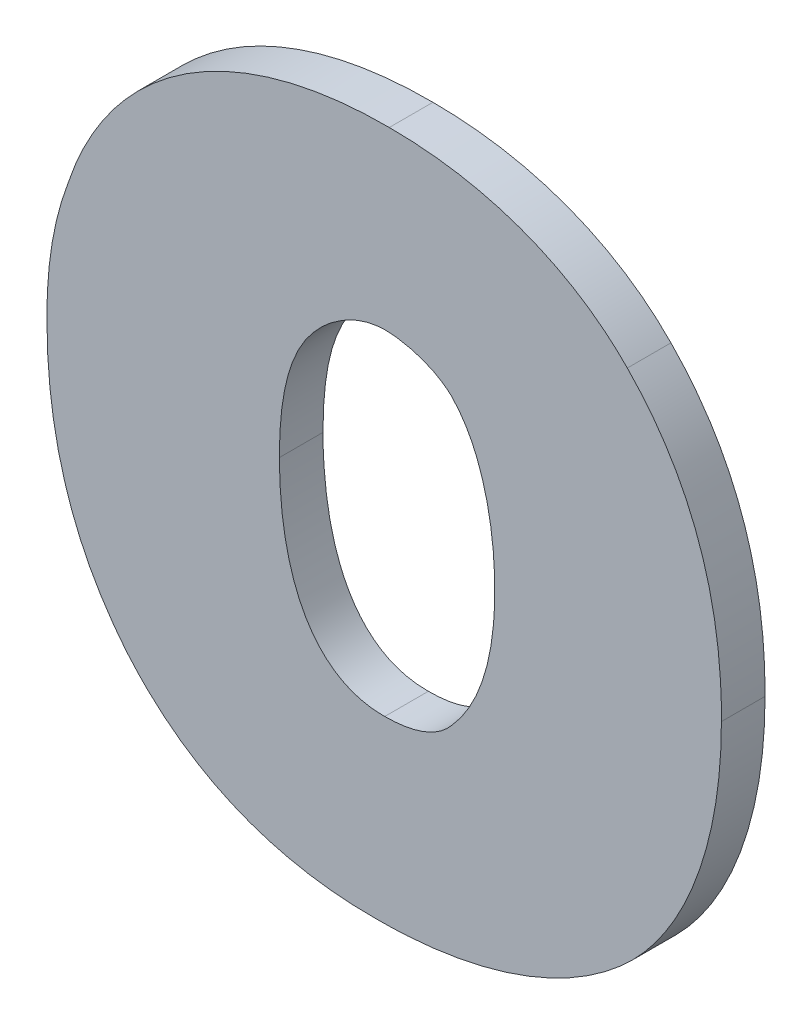
ISO-10303-21;
HEADER;
FILE_DESCRIPTION(('STEP AP214'),'2;1');
FILE_NAME('part.step','',(''),(''),'','','');
FILE_SCHEMA(('AUTOMOTIVE_DESIGN { 1 0 10303 214 1 1 1 1 }'));
ENDSEC;
DATA;
#1=APPLICATION_CONTEXT('core data for automotive mechanical design processes');
#2=APPLICATION_PROTOCOL_DEFINITION('international standard','automotive_design',2000,#1);
#3=PRODUCT_CONTEXT('',#1,'mechanical');
#4=PRODUCT('Part','Part','',(#3));
#5=PRODUCT_RELATED_PRODUCT_CATEGORY('part','',(#4));
#6=PRODUCT_DEFINITION_FORMATION('','',#4);
#7=PRODUCT_DEFINITION_CONTEXT('part definition',#1,'design');
#8=PRODUCT_DEFINITION('design','',#6,#7);
#9=PRODUCT_DEFINITION_SHAPE('','',#8);
#10=(LENGTH_UNIT() NAMED_UNIT(*) SI_UNIT(.MILLI.,.METRE.));
#11=(NAMED_UNIT(*) PLANE_ANGLE_UNIT() SI_UNIT($,.RADIAN.));
#12=(NAMED_UNIT(*) SI_UNIT($,.STERADIAN.) SOLID_ANGLE_UNIT());
#13=UNCERTAINTY_MEASURE_WITH_UNIT(LENGTH_MEASURE(1.E-05),#10,'distance_accuracy_value','');
#14=(GEOMETRIC_REPRESENTATION_CONTEXT(3) GLOBAL_UNCERTAINTY_ASSIGNED_CONTEXT((#13)) GLOBAL_UNIT_ASSIGNED_CONTEXT((#10,
#11,#12)) REPRESENTATION_CONTEXT('',''));
#15=CARTESIAN_POINT('',(0.,0.,0.));
#16=DIRECTION('',(0.,0.,1.));
#17=DIRECTION('',(1.,0.,0.));
#18=AXIS2_PLACEMENT_3D('',#15,#16,#17);
#19=CARTESIAN_POINT('',(0.124377772975997,-0.190998499455656,0.));
#20=CARTESIAN_POINT('',(0.124377772975997,-0.190998499455656,0.003));
#21=CARTESIAN_POINT('',(0.124377774804017,-0.185379031125288,0.));
#22=CARTESIAN_POINT('',(0.124377774804017,-0.185379031125288,0.003));
#23=CARTESIAN_POINT('',(0.125858627399625,-0.182877163374568,0.));
#24=CARTESIAN_POINT('',(0.125858627399625,-0.182877163374568,0.003));
#25=CARTESIAN_POINT('',(0.127885063400016,-0.181232615690537,0.));
#26=CARTESIAN_POINT('',(0.127885063400016,-0.181232615690537,0.003));
#27=B_SPLINE_SURFACE_WITH_KNOTS('',3,1,((#19,#20),(#21,#22),(#23,#24),(#25,#26)),.UNSPECIFIED.,
.F.,.F.,.F.,(4,4),(2,2),(0.,1.),(0.,0.0003),.UNSPECIFIED.);
#28=CARTESIAN_POINT('',(0.124377772975997,-0.190998499455656,0.));
#29=CARTESIAN_POINT('',(0.124377774804017,-0.185379031125288,0.));
#30=CARTESIAN_POINT('',(0.125858627399625,-0.182877163374568,0.));
#31=CARTESIAN_POINT('',(0.127885063400016,-0.181232615690537,0.));
#32=B_SPLINE_CURVE_WITH_KNOTS('',3,(#28,#29,#30,#31),.UNSPECIFIED.,.F.,.F.,(4,4),(0.,1.),.UNSPECIFIED.);
#33=CARTESIAN_POINT('',(0.124377772975997,-0.190998499455656,0.));
#34=VERTEX_POINT('',#33);
#35=CARTESIAN_POINT('',(0.127885063400016,-0.181232615690537,0.));
#36=VERTEX_POINT('',#35);
#37=EDGE_CURVE('E11',#34,#36,#32,.T.);
#38=DIRECTION('',(0.,0.,1.));
#39=VECTOR('',#38,1.);
#40=CARTESIAN_POINT('',(0.127885063400016,-0.181232615690537,0.));
#41=LINE('',#40,#39);
#42=CARTESIAN_POINT('',(0.127885063400016,-0.181232615690537,0.003));
#43=VERTEX_POINT('',#42);
#44=EDGE_CURVE('E26',#36,#43,#41,.T.);
#45=CARTESIAN_POINT('',(0.124377772975997,-0.190998499455656,0.003));
#46=CARTESIAN_POINT('',(0.124377774804017,-0.185379031125288,0.003));
#47=CARTESIAN_POINT('',(0.125858627399625,-0.182877163374568,0.003));
#48=CARTESIAN_POINT('',(0.127885063400016,-0.181232615690537,0.003));
#49=B_SPLINE_CURVE_WITH_KNOTS('',3,(#45,#46,#47,#48),.UNSPECIFIED.,.F.,.F.,(4,4),(0.,1.),.UNSPECIFIED.);
#50=CARTESIAN_POINT('',(0.124377772975997,-0.190998499455656,0.003));
#51=VERTEX_POINT('',#50);
#52=EDGE_CURVE('E528',#51,#43,#49,.T.);
#53=DIRECTION('',(0.,0.,1.));
#54=VECTOR('',#53,1.);
#55=CARTESIAN_POINT('',(0.124377772975997,-0.190998499455656,0.));
#56=LINE('',#55,#54);
#57=EDGE_CURVE('E533',#34,#51,#56,.T.);
#58=ORIENTED_EDGE('',*,*,#37,.T.);
#59=ORIENTED_EDGE('',*,*,#44,.T.);
#60=ORIENTED_EDGE('',*,*,#52,.F.);
#61=ORIENTED_EDGE('',*,*,#57,.F.);
#62=EDGE_LOOP('',(#58,#59,#60,#61));
#63=FACE_BOUND('',#62,.T.);
#64=ADVANCED_FACE('F17',(#63),#27,.T.);
#65=CARTESIAN_POINT('',(0.124377772975997,-0.190998499455656,0.));
#66=CARTESIAN_POINT('',(0.124427953984096,-0.202875820342947,0.));
#67=CARTESIAN_POINT('',(0.131626178177405,-0.20279080390148,0.));
#68=CARTESIAN_POINT('',(0.124377772975997,-0.190998499455656,0.003));
#69=CARTESIAN_POINT('',(0.124427953984096,-0.202875820342947,0.003));
#70=CARTESIAN_POINT('',(0.131626178177405,-0.20279080390148,0.003));
#71=(BOUNDED_SURFACE() B_SPLINE_SURFACE(1,2,((#65,#66,#67),(#68,#69,#70)),.UNSPECIFIED.,.F.,.F.,
.F.) B_SPLINE_SURFACE_WITH_KNOTS((2,2),(3,3),(0.,0.0703854944655545),(-3.76705345508361,
-2.96138373353767),
.UNSPECIFIED.) GEOMETRIC_REPRESENTATION_ITEM() RATIONAL_B_SPLINE_SURFACE(((1.,0.919953347677428,
1.),(1.,0.919953347677428,1.))) REPRESENTATION_ITEM('') SURFACE());
#72=CARTESIAN_POINT('',(0.131626178177405,-0.20279080390148,0.));
#73=CARTESIAN_POINT('',(0.124427953984096,-0.202875820342947,0.));
#74=CARTESIAN_POINT('',(0.124377772975997,-0.190998499455656,0.));
#75=(BOUNDED_CURVE() B_SPLINE_CURVE(2,(#72,#73,#74),.UNSPECIFIED.,.F.,
.F.) B_SPLINE_CURVE_WITH_KNOTS((3,3),(-3.76705345508361,-2.96138373353767),
.UNSPECIFIED.) CURVE() GEOMETRIC_REPRESENTATION_ITEM() RATIONAL_B_SPLINE_CURVE((1.,
0.919953347677428,1.)) REPRESENTATION_ITEM(''));
#76=CARTESIAN_POINT('',(0.131626178177405,-0.20279080390148,0.));
#77=VERTEX_POINT('',#76);
#78=EDGE_CURVE('E532',#77,#34,#75,.T.);
#79=CARTESIAN_POINT('',(0.124377772975997,-0.190998499455656,0.003));
#80=CARTESIAN_POINT('',(0.124427953984096,-0.202875820342947,0.003));
#81=CARTESIAN_POINT('',(0.131626178177405,-0.20279080390148,0.003));
#82=(BOUNDED_CURVE() B_SPLINE_CURVE(2,(#79,#80,#81),.UNSPECIFIED.,.F.,
.F.) B_SPLINE_CURVE_WITH_KNOTS((3,3),(-3.76705345508361,-2.96138373353767),
.UNSPECIFIED.) CURVE() GEOMETRIC_REPRESENTATION_ITEM() RATIONAL_B_SPLINE_CURVE((1.,
0.919953347677428,1.)) REPRESENTATION_ITEM(''));
#83=CARTESIAN_POINT('',(0.131626178177405,-0.20279080390148,0.003));
#84=VERTEX_POINT('',#83);
#85=EDGE_CURVE('E516',#84,#51,#82,.F.);
#86=DIRECTION('',(0.,0.,1.));
#87=VECTOR('',#86,1.);
#88=CARTESIAN_POINT('',(0.131626178177405,-0.20279080390148,0.));
#89=LINE('',#88,#87);
#90=EDGE_CURVE('E505',#77,#84,#89,.T.);
#91=ORIENTED_EDGE('',*,*,#78,.T.);
#92=ORIENTED_EDGE('',*,*,#57,.T.);
#93=ORIENTED_EDGE('',*,*,#85,.F.);
#94=ORIENTED_EDGE('',*,*,#90,.F.);
#95=EDGE_LOOP('',(#91,#92,#93,#94));
#96=FACE_BOUND('',#95,.T.);
#97=ADVANCED_FACE('F471',(#96),#71,.T.);
#98=CARTESIAN_POINT('',(0.131626178177405,-0.20279080390148,0.));
#99=CARTESIAN_POINT('',(0.134743045230329,-0.20278928328431,0.));
#100=CARTESIAN_POINT('',(0.136224645351293,-0.201029366327081,0.));
#101=CARTESIAN_POINT('',(0.131626178177405,-0.20279080390148,0.003));
#102=CARTESIAN_POINT('',(0.134743045230329,-0.20278928328431,0.003));
#103=CARTESIAN_POINT('',(0.136224645351293,-0.201029366327081,0.003));
#104=(BOUNDED_SURFACE() B_SPLINE_SURFACE(1,2,((#98,#99,#100),(#101,#102,#103)),.UNSPECIFIED.,
.F.,.F.,.F.) B_SPLINE_SURFACE_WITH_KNOTS((2,2),(3,3),(0.,0.133919362928342),(-3.59657759487651,
-3.13103510034239),
.UNSPECIFIED.) GEOMETRIC_REPRESENTATION_ITEM() RATIONAL_B_SPLINE_SURFACE(((1.,0.973030874940233,
1.),(1.,0.973030874940233,1.))) REPRESENTATION_ITEM('') SURFACE());
#105=CARTESIAN_POINT('',(0.119377148134449,-0.186266392319519,0.));
#106=DIRECTION('',(0.,0.,-1.));
#107=DIRECTION('',(-0.749081450687916,0.662477909243234,0.));
#108=AXIS2_PLACEMENT_3D('',#105,#106,#107);
#109=ELLIPSE('',#108,0.0224015402582617,0.00970174116213284);
#110=CARTESIAN_POINT('',(0.136224645351293,-0.201029366327081,0.));
#111=VERTEX_POINT('',#110);
#112=EDGE_CURVE('E534',#111,#77,#109,.T.);
#113=CARTESIAN_POINT('',(0.119377148134449,-0.186266392319519,0.003));
#114=DIRECTION('',(0.,0.,-1.));
#115=DIRECTION('',(-0.749081450687916,0.662477909243234,0.));
#116=AXIS2_PLACEMENT_3D('',#113,#114,#115);
#117=ELLIPSE('',#116,0.0224015402582617,0.00970174116213284);
#118=CARTESIAN_POINT('',(0.136224645351293,-0.201029366327081,0.003));
#119=VERTEX_POINT('',#118);
#120=EDGE_CURVE('E531',#119,#84,#117,.T.);
#121=DIRECTION('',(0.,0.,1.));
#122=VECTOR('',#121,1.);
#123=CARTESIAN_POINT('',(0.136224645351293,-0.201029366327081,0.));
#124=LINE('',#123,#122);
#125=EDGE_CURVE('E538',#111,#119,#124,.T.);
#126=ORIENTED_EDGE('',*,*,#112,.T.);
#127=ORIENTED_EDGE('',*,*,#90,.T.);
#128=ORIENTED_EDGE('',*,*,#120,.F.);
#129=ORIENTED_EDGE('',*,*,#125,.F.);
#130=EDGE_LOOP('',(#126,#127,#128,#129));
#131=FACE_BOUND('',#130,.T.);
#132=ADVANCED_FACE('F475',(#131),#104,.T.);
#133=CARTESIAN_POINT('',(0.136224645351293,-0.201029366327081,0.));
#134=CARTESIAN_POINT('',(0.139284838697724,-0.197617555893492,0.));
#135=CARTESIAN_POINT('',(0.139186358096804,-0.191224510053673,0.));
#136=CARTESIAN_POINT('',(0.136224645351293,-0.201029366327081,0.003));
#137=CARTESIAN_POINT('',(0.139284838697724,-0.197617555893492,0.003));
#138=CARTESIAN_POINT('',(0.139186358096804,-0.191224510053673,0.003));
#139=(BOUNDED_SURFACE() B_SPLINE_SURFACE(1,2,((#133,#134,#135),(#136,#137,#138)),.UNSPECIFIED.,
.F.,.F.,.F.) B_SPLINE_SURFACE_WITH_KNOTS((2,2),(3,3),(0.,0.0699700113703324),(-3.06469083303229,
-2.60817138741596),
.UNSPECIFIED.) GEOMETRIC_REPRESENTATION_ITEM() RATIONAL_B_SPLINE_SURFACE(((1.,0.974061664484106,
1.),(1.,0.974061664484106,1.))) REPRESENTATION_ITEM('') SURFACE());
#140=CARTESIAN_POINT('',(0.139186358096804,-0.191224510053673,0.));
#141=CARTESIAN_POINT('',(0.139284838697724,-0.197617555893492,0.));
#142=CARTESIAN_POINT('',(0.136224645351293,-0.201029366327081,0.));
#143=(BOUNDED_CURVE() B_SPLINE_CURVE(2,(#140,#141,#142),.UNSPECIFIED.,.F.,
.F.) B_SPLINE_CURVE_WITH_KNOTS((3,3),(-3.06469083303229,-2.60817138741596),
.UNSPECIFIED.) CURVE() GEOMETRIC_REPRESENTATION_ITEM() RATIONAL_B_SPLINE_CURVE((1.,
0.974061664484106,1.)) REPRESENTATION_ITEM(''));
#144=CARTESIAN_POINT('',(0.139186358096804,-0.191224510053673,0.));
#145=VERTEX_POINT('',#144);
#146=EDGE_CURVE('E548',#145,#111,#143,.T.);
#147=CARTESIAN_POINT('',(0.136224645351293,-0.201029366327081,0.003));
#148=CARTESIAN_POINT('',(0.139284838697724,-0.197617555893492,0.003));
#149=CARTESIAN_POINT('',(0.139186358096804,-0.191224510053673,0.003));
#150=(BOUNDED_CURVE() B_SPLINE_CURVE(2,(#147,#148,#149),.UNSPECIFIED.,.F.,
.F.) B_SPLINE_CURVE_WITH_KNOTS((3,3),(-3.06469083303229,-2.60817138741596),
.UNSPECIFIED.) CURVE() GEOMETRIC_REPRESENTATION_ITEM() RATIONAL_B_SPLINE_CURVE((1.,
0.974061664484106,1.)) REPRESENTATION_ITEM(''));
#151=CARTESIAN_POINT('',(0.139186358096804,-0.191224510053673,0.003));
#152=VERTEX_POINT('',#151);
#153=EDGE_CURVE('E590',#152,#119,#150,.F.);
#154=DIRECTION('',(0.,0.,1.));
#155=VECTOR('',#154,1.);
#156=CARTESIAN_POINT('',(0.139186358096804,-0.191224510053673,0.));
#157=LINE('',#156,#155);
#158=EDGE_CURVE('E582',#145,#152,#157,.T.);
#159=ORIENTED_EDGE('',*,*,#146,.T.);
#160=ORIENTED_EDGE('',*,*,#125,.T.);
#161=ORIENTED_EDGE('',*,*,#153,.F.);
#162=ORIENTED_EDGE('',*,*,#158,.F.);
#163=EDGE_LOOP('',(#159,#160,#161,#162));
#164=FACE_BOUND('',#163,.T.);
#165=ADVANCED_FACE('F480',(#164),#139,.T.);
#166=CARTESIAN_POINT('',(0.136224645351293,-0.181427467535528,0.));
#167=CARTESIAN_POINT('',(0.136224645351293,-0.181427467535528,0.003));
#168=CARTESIAN_POINT('',(0.139264301446064,-0.184537272584264,0.));
#169=CARTESIAN_POINT('',(0.139264301446064,-0.184537272584264,0.003));
#170=CARTESIAN_POINT('',(0.139186358032652,-0.190967308613292,0.));
#171=CARTESIAN_POINT('',(0.139186358032652,-0.190967308613292,0.003));
#172=CARTESIAN_POINT('',(0.139186358096804,-0.191224510053673,0.));
#173=CARTESIAN_POINT('',(0.139186358096804,-0.191224510053673,0.003));
#174=B_SPLINE_SURFACE_WITH_KNOTS('',3,1,((#166,#167),(#168,#169),(#170,#171),(#172,#173)),
.UNSPECIFIED.,.F.,.F.,.F.,(4,4),(2,2),(0.,1.),(0.,0.0003),.UNSPECIFIED.);
#175=CARTESIAN_POINT('',(0.136224645351293,-0.181427467535528,0.));
#176=CARTESIAN_POINT('',(0.139264301446064,-0.184537272584264,0.));
#177=CARTESIAN_POINT('',(0.139186358032652,-0.190967308613292,0.));
#178=CARTESIAN_POINT('',(0.139186358096804,-0.191224510053673,0.));
#179=B_SPLINE_CURVE_WITH_KNOTS('',3,(#175,#176,#177,#178),.UNSPECIFIED.,.F.,.F.,(4,4),(0.,1.),.UNSPECIFIED.);
#180=CARTESIAN_POINT('',(0.136224645351293,-0.181427467535528,0.));
#181=VERTEX_POINT('',#180);
#182=EDGE_CURVE('E602',#181,#145,#179,.T.);
#183=CARTESIAN_POINT('',(0.136224645351293,-0.181427467535528,0.003));
#184=CARTESIAN_POINT('',(0.139264301446064,-0.184537272584264,0.003));
#185=CARTESIAN_POINT('',(0.139186358032652,-0.190967308613292,0.003));
#186=CARTESIAN_POINT('',(0.139186358096804,-0.191224510053673,0.003));
#187=B_SPLINE_CURVE_WITH_KNOTS('',3,(#183,#184,#185,#186),.UNSPECIFIED.,.F.,.F.,(4,4),(0.,1.),.UNSPECIFIED.);
#188=CARTESIAN_POINT('',(0.136224645351293,-0.181427467535528,0.003));
#189=VERTEX_POINT('',#188);
#190=EDGE_CURVE('E601',#189,#152,#187,.T.);
#191=DIRECTION('',(0.,0.,1.));
#192=VECTOR('',#191,1.);
#193=CARTESIAN_POINT('',(0.136224645351293,-0.181427467535528,0.));
#194=LINE('',#193,#192);
#195=EDGE_CURVE('E607',#181,#189,#194,.T.);
#196=ORIENTED_EDGE('',*,*,#182,.T.);
#197=ORIENTED_EDGE('',*,*,#158,.T.);
#198=ORIENTED_EDGE('',*,*,#190,.F.);
#199=ORIENTED_EDGE('',*,*,#195,.F.);
#200=EDGE_LOOP('',(#196,#197,#198,#199));
#201=FACE_BOUND('',#200,.T.);
#202=ADVANCED_FACE('F567',(#201),#174,.T.);
#203=CARTESIAN_POINT('',(0.131704112497488,-0.179759554354273,0.));
#204=CARTESIAN_POINT('',(0.131704112497488,-0.179759554354273,0.003));
#205=CARTESIAN_POINT('',(0.132483510005816,-0.179759564500286,0.));
#206=CARTESIAN_POINT('',(0.132483510005816,-0.179759564500286,0.003));
#207=CARTESIAN_POINT('',(0.13474378254198,-0.180040152942489,0.));
#208=CARTESIAN_POINT('',(0.13474378254198,-0.180040152942489,0.003));
#209=CARTESIAN_POINT('',(0.136224645351293,-0.181427467535528,0.));
#210=CARTESIAN_POINT('',(0.136224645351293,-0.181427467535528,0.003));
#211=B_SPLINE_SURFACE_WITH_KNOTS('',3,1,((#203,#204),(#205,#206),(#207,#208),(#209,#210)),
.UNSPECIFIED.,.F.,.F.,.F.,(4,4),(2,2),(0.,1.),(0.,0.0003),.UNSPECIFIED.);
#212=CARTESIAN_POINT('',(0.131704112497488,-0.179759554354273,0.));
#213=CARTESIAN_POINT('',(0.132483510005816,-0.179759564500286,0.));
#214=CARTESIAN_POINT('',(0.13474378254198,-0.180040152942489,0.));
#215=CARTESIAN_POINT('',(0.136224645351293,-0.181427467535528,0.));
#216=B_SPLINE_CURVE_WITH_KNOTS('',3,(#212,#213,#214,#215),.UNSPECIFIED.,.F.,.F.,(4,4),(0.,1.),.UNSPECIFIED.);
#217=CARTESIAN_POINT('',(0.131704112497488,-0.179759554354273,0.));
#218=VERTEX_POINT('',#217);
#219=EDGE_CURVE('E627',#218,#181,#216,.T.);
#220=CARTESIAN_POINT('',(0.131704112497488,-0.179759554354273,0.003));
#221=CARTESIAN_POINT('',(0.132483510005816,-0.179759564500286,0.003));
#222=CARTESIAN_POINT('',(0.13474378254198,-0.180040152942489,0.003));
#223=CARTESIAN_POINT('',(0.136224645351293,-0.181427467535528,0.003));
#224=B_SPLINE_CURVE_WITH_KNOTS('',3,(#220,#221,#222,#223),.UNSPECIFIED.,.F.,.F.,(4,4),(0.,1.),.UNSPECIFIED.);
#225=CARTESIAN_POINT('',(0.131704112497488,-0.179759554354273,0.003));
#226=VERTEX_POINT('',#225);
#227=EDGE_CURVE('E632',#226,#189,#224,.T.);
#228=DIRECTION('',(0.,0.,1.));
#229=VECTOR('',#228,1.);
#230=CARTESIAN_POINT('',(0.131704112497488,-0.179759554354273,0.));
#231=LINE('',#230,#229);
#232=EDGE_CURVE('E639',#218,#226,#231,.T.);
#233=ORIENTED_EDGE('',*,*,#219,.T.);
#234=ORIENTED_EDGE('',*,*,#195,.T.);
#235=ORIENTED_EDGE('',*,*,#227,.F.);
#236=ORIENTED_EDGE('',*,*,#232,.F.);
#237=EDGE_LOOP('',(#233,#234,#235,#236));
#238=FACE_BOUND('',#237,.T.);
#239=ADVANCED_FACE('F707',(#238),#211,.T.);
#240=CARTESIAN_POINT('',(0.127885063400016,-0.181232615690537,0.));
#241=CARTESIAN_POINT('',(0.127885063400016,-0.181232615690537,0.003));
#242=CARTESIAN_POINT('',(0.128352700610829,-0.180889711753622,0.));
#243=CARTESIAN_POINT('',(0.128352700610829,-0.180889711753622,0.003));
#244=CARTESIAN_POINT('',(0.129755636833329,-0.179759562196934,0.));
#245=CARTESIAN_POINT('',(0.129755636833329,-0.179759562196934,0.003));
#246=CARTESIAN_POINT('',(0.131704112497488,-0.179759554354273,0.));
#247=CARTESIAN_POINT('',(0.131704112497488,-0.179759554354273,0.003));
#248=B_SPLINE_SURFACE_WITH_KNOTS('',3,1,((#240,#241),(#242,#243),(#244,#245),(#246,#247)),
.UNSPECIFIED.,.F.,.F.,.F.,(4,4),(2,2),(0.,1.),(0.,0.0003),.UNSPECIFIED.);
#249=CARTESIAN_POINT('',(0.127885063400016,-0.181232615690537,0.));
#250=CARTESIAN_POINT('',(0.128352700610829,-0.180889711753622,0.));
#251=CARTESIAN_POINT('',(0.129755636833329,-0.179759562196934,0.));
#252=CARTESIAN_POINT('',(0.131704112497488,-0.179759554354273,0.));
#253=B_SPLINE_CURVE_WITH_KNOTS('',3,(#249,#250,#251,#252),.UNSPECIFIED.,.F.,.F.,(4,4),(0.,1.),.UNSPECIFIED.);
#254=EDGE_CURVE('E645',#36,#218,#253,.T.);
#255=CARTESIAN_POINT('',(0.127885063400016,-0.181232615690537,0.003));
#256=CARTESIAN_POINT('',(0.128352700610829,-0.180889711753622,0.003));
#257=CARTESIAN_POINT('',(0.129755636833329,-0.179759562196934,0.003));
#258=CARTESIAN_POINT('',(0.131704112497488,-0.179759554354273,0.003));
#259=B_SPLINE_CURVE_WITH_KNOTS('',3,(#255,#256,#257,#258),.UNSPECIFIED.,.F.,.F.,(4,4),(0.,1.),.UNSPECIFIED.);
#260=EDGE_CURVE('E650',#43,#226,#259,.T.);
#261=ORIENTED_EDGE('',*,*,#254,.T.);
#262=ORIENTED_EDGE('',*,*,#232,.T.);
#263=ORIENTED_EDGE('',*,*,#260,.F.);
#264=ORIENTED_EDGE('',*,*,#44,.F.);
#265=EDGE_LOOP('',(#261,#262,#263,#264));
#266=FACE_BOUND('',#265,.T.);
#267=ADVANCED_FACE('F703',(#266),#248,.T.);
#268=CARTESIAN_POINT('',(0.148305326035152,-0.173703626613429,0.));
#269=CARTESIAN_POINT('',(0.142338513262186,-0.167550695881454,0.));
#270=CARTESIAN_POINT('',(0.131937936850724,-0.167561956145416,0.));
#271=CARTESIAN_POINT('',(0.148305326035152,-0.173703626613429,0.003));
#272=CARTESIAN_POINT('',(0.142338513262186,-0.167550695881454,0.003));
#273=CARTESIAN_POINT('',(0.131937936850724,-0.167561956145416,0.003));
#274=(BOUNDED_SURFACE() B_SPLINE_SURFACE(1,2,((#268,#269,#270),(#271,#272,#273)),.UNSPECIFIED.,
.F.,.F.,.F.) B_SPLINE_SURFACE_WITH_KNOTS((2,2),(3,3),(0.,0.103252710583918),(0.211142117529624,
0.951344990772793),
.UNSPECIFIED.) GEOMETRIC_REPRESENTATION_ITEM() RATIONAL_B_SPLINE_SURFACE(((1.,0.932290659761827,
1.),(1.,0.932290659761827,1.))) REPRESENTATION_ITEM('') SURFACE());
#275=CARTESIAN_POINT('',(0.148305326035152,-0.173703626613429,0.));
#276=CARTESIAN_POINT('',(0.148071721488255,-0.173462705837534,0.));
#277=CARTESIAN_POINT('',(0.147831012741318,-0.173228718705121,0.));
#278=CARTESIAN_POINT('',(0.147332583020849,-0.172771338099426,0.));
#279=CARTESIAN_POINT('',(0.147074651565308,-0.172548173846438,0.));
#280=CARTESIAN_POINT('',(0.146542238825559,-0.172113405195117,0.));
#281=CARTESIAN_POINT('',(0.146267557198352,-0.171902046466993,0.));
#282=CARTESIAN_POINT('',(0.1457022294252,-0.171491767379762,0.));
#283=CARTESIAN_POINT('',(0.145411396502354,-0.17129310464516,0.));
#284=CARTESIAN_POINT('',(0.144814465666733,-0.170909047211857,0.));
#285=CARTESIAN_POINT('',(0.144508197347818,-0.170723917712592,0.));
#286=CARTESIAN_POINT('',(0.143881206807192,-0.170367683889605,0.));
#287=CARTESIAN_POINT('',(0.143560332695349,-0.170196847276588,0.));
#288=CARTESIAN_POINT('',(0.14290504654564,-0.16986987815904,0.));
#289=CARTESIAN_POINT('',(0.142570502482031,-0.169714010666194,0.));
#290=CARTESIAN_POINT('',(0.141888889412266,-0.169417571032625,0.));
#291=CARTESIAN_POINT('',(0.141541708770812,-0.169277256025485,0.));
#292=CARTESIAN_POINT('',(0.140835922787452,-0.169012417904497,0.));
#293=CARTESIAN_POINT('',(0.140477225928806,-0.168888139152556,0.));
#294=CARTESIAN_POINT('',(0.139749583756335,-0.168655769387321,0.));
#295=CARTESIAN_POINT('',(0.139380566052948,-0.168547905546005,0.));
#296=CARTESIAN_POINT('',(0.138633521892978,-0.168348656390856,0.));
#297=CARTESIAN_POINT('',(0.13825544057784,-0.168257477264723,0.));
#298=CARTESIAN_POINT('',(0.137491558615948,-0.168091780609868,0.));
#299=CARTESIAN_POINT('',(0.137105718574641,-0.168017445210264,0.));
#300=CARTESIAN_POINT('',(0.13632764440719,-0.167885510270206,0.));
#301=CARTESIAN_POINT('',(0.135935383961326,-0.167828066490857,0.));
#302=CARTESIAN_POINT('',(0.135145813608878,-0.167729881624575,0.));
#303=CARTESIAN_POINT('',(0.13474848786593,-0.167689268395315,0.));
#304=CARTESIAN_POINT('',(0.1339501426179,-0.167624604482829,0.));
#305=CARTESIAN_POINT('',(0.133549115151021,-0.167600652940776,0.));
#306=CARTESIAN_POINT('',(0.13274469437098,-0.167569077368965,0.));
#307=CARTESIAN_POINT('',(0.132341298278856,-0.167561523670221,0.));
#308=CARTESIAN_POINT('',(0.131937936850725,-0.167561956145416,0.));
#309=B_SPLINE_CURVE_WITH_KNOTS('',3,(#275,#276,#277,#278,#279,#280,#281,#282,#283,#284,#285,
#286,#287,#288,#289,#290,#291,#292,#293,#294,#295,#296,#297,#298,#299,#300,#301,#302,#303,#304,
#305,#306,#307,#308),.UNSPECIFIED.,.F.,.F.,(4,2,2,2,2,2,2,2,2,2,2,2,2,2,2,2,4),(0.,
0.00100654744688566,0.00202918968937954,0.00306838966482846,0.00412445990291879,
0.00519753763462711,0.00628756444417344,0.00739427127148094,0.00851716928580086,
0.00965554685641854,0.010808472564904,0.0119748039513947,0.0131532014757434,0.0143421470090222,
0.0155399660537985,0.0167448528217031,0.0179548972707775),.UNSPECIFIED.);
#310=CARTESIAN_POINT('',(0.148305326035152,-0.173703626613429,0.));
#311=VERTEX_POINT('',#310);
#312=CARTESIAN_POINT('',(0.131937936850724,-0.167561956145416,0.));
#313=VERTEX_POINT('',#312);
#314=EDGE_CURVE('E657',#311,#313,#309,.T.);
#315=DIRECTION('',(0.,0.,1.));
#316=VECTOR('',#315,1.);
#317=CARTESIAN_POINT('',(0.131937936850724,-0.167561956145416,0.));
#318=LINE('',#317,#316);
#319=CARTESIAN_POINT('',(0.131937936850724,-0.167561956145416,0.003));
#320=VERTEX_POINT('',#319);
#321=EDGE_CURVE('E675',#313,#320,#318,.T.);
#322=CARTESIAN_POINT('',(0.131937936850724,-0.167561956145416,0.003));
#323=CARTESIAN_POINT('',(0.142338513262186,-0.167550695881454,0.003));
#324=CARTESIAN_POINT('',(0.148305326035152,-0.173703626613429,0.003));
#325=(BOUNDED_CURVE() B_SPLINE_CURVE(2,(#322,#323,#324),.UNSPECIFIED.,.F.,
.F.) B_SPLINE_CURVE_WITH_KNOTS((3,3),(0.211142117529624,0.951344990772793),
.UNSPECIFIED.) CURVE() GEOMETRIC_REPRESENTATION_ITEM() RATIONAL_B_SPLINE_CURVE((1.,
0.932290659761827,1.)) REPRESENTATION_ITEM(''));
#326=CARTESIAN_POINT('',(0.148305326035152,-0.173703626613429,0.003));
#327=VERTEX_POINT('',#326);
#328=EDGE_CURVE('E149',#327,#320,#325,.F.);
#329=DIRECTION('',(0.,0.,1.));
#330=VECTOR('',#329,1.);
#331=CARTESIAN_POINT('',(0.148305326035152,-0.173703626613429,0.));
#332=LINE('',#331,#330);
#333=EDGE_CURVE('E280',#311,#327,#332,.T.);
#334=ORIENTED_EDGE('',*,*,#314,.T.);
#335=ORIENTED_EDGE('',*,*,#321,.T.);
#336=ORIENTED_EDGE('',*,*,#328,.F.);
#337=ORIENTED_EDGE('',*,*,#333,.F.);
#338=EDGE_LOOP('',(#334,#335,#336,#337));
#339=FACE_BOUND('',#338,.T.);
#340=ADVANCED_FACE('F242',(#339),#274,.F.);
#341=CARTESIAN_POINT('',(0.154774345249488,-0.191520684002345,0.));
#342=CARTESIAN_POINT('',(0.154865785374401,-0.180378147764507,0.));
#343=CARTESIAN_POINT('',(0.148305326035153,-0.173703626613428,0.));
#344=CARTESIAN_POINT('',(0.154774345249488,-0.191520684002345,0.003));
#345=CARTESIAN_POINT('',(0.154865785374401,-0.180378147764507,0.003));
#346=CARTESIAN_POINT('',(0.148305326035153,-0.173703626613428,0.003));
#347=(BOUNDED_SURFACE() B_SPLINE_SURFACE(1,2,((#341,#342,#343),(#344,#345,#346)),.UNSPECIFIED.,
.F.,.F.,.F.) B_SPLINE_SURFACE_WITH_KNOTS((2,2),(3,3),(0.,0.0187053172343839),
(-0.262424774866607,0.0537682010711859),
.UNSPECIFIED.) GEOMETRIC_REPRESENTATION_ITEM() RATIONAL_B_SPLINE_SURFACE(((1.,0.987528758777129,
1.),(1.,0.987528758777129,1.))) REPRESENTATION_ITEM('') SURFACE());
#348=CARTESIAN_POINT('',(0.154774345249488,-0.191520684002345,0.));
#349=CARTESIAN_POINT('',(0.154865785374401,-0.180378147764507,0.));
#350=CARTESIAN_POINT('',(0.148305326035153,-0.173703626613428,0.));
#351=(BOUNDED_CURVE() B_SPLINE_CURVE(2,(#348,#349,#350),.UNSPECIFIED.,.F.,
.F.) B_SPLINE_CURVE_WITH_KNOTS((3,3),(-0.262424774866607,0.0537682010711859),
.UNSPECIFIED.) CURVE() GEOMETRIC_REPRESENTATION_ITEM() RATIONAL_B_SPLINE_CURVE((1.,
0.987528758777129,1.)) REPRESENTATION_ITEM(''));
#352=CARTESIAN_POINT('',(0.154774345249488,-0.191520684002345,0.));
#353=VERTEX_POINT('',#352);
#354=EDGE_CURVE('E222',#353,#311,#351,.T.);
#355=CARTESIAN_POINT('',(0.148305326035153,-0.173703626613428,0.003));
#356=CARTESIAN_POINT('',(0.154865785374401,-0.180378147764507,0.003));
#357=CARTESIAN_POINT('',(0.154774345249488,-0.191520684002345,0.003));
#358=(BOUNDED_CURVE() B_SPLINE_CURVE(2,(#355,#356,#357),.UNSPECIFIED.,.F.,
.F.) B_SPLINE_CURVE_WITH_KNOTS((3,3),(-0.262424774866607,0.0537682010711859),
.UNSPECIFIED.) CURVE() GEOMETRIC_REPRESENTATION_ITEM() RATIONAL_B_SPLINE_CURVE((1.,
0.987528758777129,1.)) REPRESENTATION_ITEM(''));
#359=CARTESIAN_POINT('',(0.154774345249488,-0.191520684002345,0.003));
#360=VERTEX_POINT('',#359);
#361=EDGE_CURVE('E271',#360,#327,#358,.F.);
#362=DIRECTION('',(0.,0.,1.));
#363=VECTOR('',#362,1.);
#364=CARTESIAN_POINT('',(0.154774345249488,-0.191520684002345,0.));
#365=LINE('',#364,#363);
#366=EDGE_CURVE('E263',#353,#360,#365,.T.);
#367=ORIENTED_EDGE('',*,*,#354,.T.);
#368=ORIENTED_EDGE('',*,*,#333,.T.);
#369=ORIENTED_EDGE('',*,*,#361,.F.);
#370=ORIENTED_EDGE('',*,*,#366,.F.);
#371=EDGE_LOOP('',(#367,#368,#369,#370));
#372=FACE_BOUND('',#371,.T.);
#373=ADVANCED_FACE('F229',(#372),#347,.F.);
#374=CARTESIAN_POINT('',(0.148695024376868,-0.208737622524424,0.));
#375=CARTESIAN_POINT('',(0.154787122487904,-0.202606581481411,0.));
#376=CARTESIAN_POINT('',(0.154774345249488,-0.191520684002345,0.));
#377=CARTESIAN_POINT('',(0.148695024376868,-0.208737622524424,0.003));
#378=CARTESIAN_POINT('',(0.154787122487904,-0.202606581481411,0.003));
#379=CARTESIAN_POINT('',(0.154774345249488,-0.191520684002345,0.003));
#380=(BOUNDED_SURFACE() B_SPLINE_SURFACE(1,2,((#374,#375,#376),(#377,#378,#379)),.UNSPECIFIED.,
.F.,.F.,.F.) B_SPLINE_SURFACE_WITH_KNOTS((2,2),(3,3),(0.,0.113748676422392),(0.388401314537226,
1.20787896461803),.UNSPECIFIED.) GEOMETRIC_REPRESENTATION_ITEM() RATIONAL_B_SPLINE_SURFACE(((1.,
0.917224898311067,1.),(1.,0.917224898311067,1.))) REPRESENTATION_ITEM('') SURFACE());
#381=CARTESIAN_POINT('',(0.148695024376868,-0.208737622524424,0.));
#382=CARTESIAN_POINT('',(0.154787122487904,-0.202606581481411,0.));
#383=CARTESIAN_POINT('',(0.154774345249488,-0.191520684002345,0.));
#384=(BOUNDED_CURVE() B_SPLINE_CURVE(2,(#381,#382,#383),.UNSPECIFIED.,.F.,
.F.) B_SPLINE_CURVE_WITH_KNOTS((3,3),(0.388401314537226,1.20787896461803),
.UNSPECIFIED.) CURVE() GEOMETRIC_REPRESENTATION_ITEM() RATIONAL_B_SPLINE_CURVE((1.,
0.917224898311067,1.)) REPRESENTATION_ITEM(''));
#385=CARTESIAN_POINT('',(0.148695024376868,-0.208737622524424,0.));
#386=VERTEX_POINT('',#385);
#387=EDGE_CURVE('E289',#386,#353,#384,.T.);
#388=CARTESIAN_POINT('',(0.154774345249488,-0.191520684002345,0.003));
#389=CARTESIAN_POINT('',(0.154787122487904,-0.202606581481411,0.003));
#390=CARTESIAN_POINT('',(0.148695024376868,-0.208737622524424,0.003));
#391=(BOUNDED_CURVE() B_SPLINE_CURVE(2,(#388,#389,#390),.UNSPECIFIED.,.F.,
.F.) B_SPLINE_CURVE_WITH_KNOTS((3,3),(0.388401314537226,1.20787896461803),
.UNSPECIFIED.) CURVE() GEOMETRIC_REPRESENTATION_ITEM() RATIONAL_B_SPLINE_CURVE((1.,
0.917224898311067,1.)) REPRESENTATION_ITEM(''));
#392=CARTESIAN_POINT('',(0.148695024376868,-0.208737622524424,0.003));
#393=VERTEX_POINT('',#392);
#394=EDGE_CURVE('E283',#393,#360,#391,.F.);
#395=DIRECTION('',(0.,0.,1.));
#396=VECTOR('',#395,1.);
#397=CARTESIAN_POINT('',(0.148695024376868,-0.208737622524424,0.));
#398=LINE('',#397,#396);
#399=EDGE_CURVE('E290',#386,#393,#398,.T.);
#400=ORIENTED_EDGE('',*,*,#387,.T.);
#401=ORIENTED_EDGE('',*,*,#366,.T.);
#402=ORIENTED_EDGE('',*,*,#394,.F.);
#403=ORIENTED_EDGE('',*,*,#399,.F.);
#404=EDGE_LOOP('',(#400,#401,#402,#403));
#405=FACE_BOUND('',#404,.T.);
#406=ADVANCED_FACE('F241',(#405),#380,.F.);
#407=CARTESIAN_POINT('',(0.131080600498896,-0.215136494432776,0.));
#408=CARTESIAN_POINT('',(0.142282866259902,-0.215173632679396,0.));
#409=CARTESIAN_POINT('',(0.148695024376868,-0.208737622524424,0.));
#410=CARTESIAN_POINT('',(0.131080600498896,-0.215136494432776,0.003));
#411=CARTESIAN_POINT('',(0.142282866259902,-0.215173632679396,0.003));
#412=CARTESIAN_POINT('',(0.148695024376868,-0.208737622524424,0.003));
#413=(BOUNDED_SURFACE() B_SPLINE_SURFACE(1,2,((#407,#408,#409),(#410,#411,#412)),.UNSPECIFIED.,
.F.,.F.,.F.) B_SPLINE_SURFACE_WITH_KNOTS((2,2),(3,3),(0.,0.105310641934754),(-1.10433756825645,
-0.322215497842727),
.UNSPECIFIED.) GEOMETRIC_REPRESENTATION_ITEM() RATIONAL_B_SPLINE_SURFACE(((1.,0.924505146010039,
1.),(1.,0.924505146010039,1.))) REPRESENTATION_ITEM('') SURFACE());
#414=CARTESIAN_POINT('',(0.131080600498896,-0.215136494432776,0.));
#415=CARTESIAN_POINT('',(0.131511975398485,-0.215137918493683,0.));
#416=CARTESIAN_POINT('',(0.131943401636902,-0.215130952063513,0.));
#417=CARTESIAN_POINT('',(0.132804772226886,-0.215099749211786,0.));
#418=CARTESIAN_POINT('',(0.133234717822373,-0.215075546923655,0.));
#419=CARTESIAN_POINT('',(0.13409154607504,-0.215009524467142,0.));
#420=CARTESIAN_POINT('',(0.134518434114187,-0.2149677747024,0.));
#421=CARTESIAN_POINT('',(0.135367521285183,-0.214866417724328,0.));
#422=CARTESIAN_POINT('',(0.135789733206853,-0.214806918064121,0.));
#423=CARTESIAN_POINT('',(0.136627838204222,-0.214669948705142,0.));
#424=CARTESIAN_POINT('',(0.137043754863974,-0.214592623806583,0.));
#425=CARTESIAN_POINT('',(0.137867648994889,-0.214420020469248,0.));
#426=CARTESIAN_POINT('',(0.138275664343316,-0.214324923343385,0.));
#427=CARTESIAN_POINT('',(0.139082166651446,-0.214116924999534,0.));
#428=CARTESIAN_POINT('',(0.13948070921776,-0.214004239935311,0.));
#429=CARTESIAN_POINT('',(0.140266727401209,-0.213761348645285,0.));
#430=CARTESIAN_POINT('',(0.140654279585171,-0.213631390758896,0.));
#431=CARTESIAN_POINT('',(0.141416848584976,-0.213354368663547,0.));
#432=CARTESIAN_POINT('',(0.141791965772279,-0.213207581325979,0.));
#433=CARTESIAN_POINT('',(0.142528284844819,-0.212897443075432,0.));
#434=CARTESIAN_POINT('',(0.142889613179859,-0.212734392952871,0.));
#435=CARTESIAN_POINT('',(0.143597080035148,-0.212392393371321,0.));
#436=CARTESIAN_POINT('',(0.143943372603131,-0.212213763150058,0.));
#437=CARTESIAN_POINT('',(0.144619613793983,-0.211841380890206,0.));
#438=CARTESIAN_POINT('',(0.144949744666951,-0.211647960363355,0.));
#439=CARTESIAN_POINT('',(0.145592641744021,-0.21124687660417,0.));
#440=CARTESIAN_POINT('',(0.145905617960973,-0.211039550537468,0.));
#441=CARTESIAN_POINT('',(0.146513327797831,-0.210611628312882,0.));
#442=CARTESIAN_POINT('',(0.146808297665792,-0.210391368090821,0.));
#443=CARTESIAN_POINT('',(0.14737927028621,-0.209938614732458,0.));
#444=CARTESIAN_POINT('',(0.147655532840864,-0.209706449852033,0.));
#445=CARTESIAN_POINT('',(0.148188513014182,-0.209231029179043,0.));
#446=CARTESIAN_POINT('',(0.148445510536514,-0.208988086898098,0.));
#447=CARTESIAN_POINT('',(0.148695024376868,-0.208737622524424,0.));
#448=B_SPLINE_CURVE_WITH_KNOTS('',3,(#414,#415,#416,#417,#418,#419,#420,#421,#422,#423,#424,
#425,#426,#427,#428,#429,#430,#431,#432,#433,#434,#435,#436,#437,#438,#439,#440,#441,#442,#443,
#444,#445,#446,#447),.UNSPECIFIED.,.F.,.F.,(4,2,2,2,2,2,2,2,2,2,2,2,2,2,2,2,4),(0.,
0.00129408512613518,0.00258561458228457,0.00387201092283893,0.00515076559277869,
0.006419477378466,0.00767588995962427,0.00891792734173335,0.0101437259297209,0.0113516620405287,
0.0125403737481805,0.0137087761122624,0.0148560690582837,0.0159817374519081,0.0170855432302133,
0.0181675098088688,0.0192278993559995),.UNSPECIFIED.);
#449=CARTESIAN_POINT('',(0.131080600498896,-0.215136494432776,0.));
#450=VERTEX_POINT('',#449);
#451=EDGE_CURVE('E309',#450,#386,#448,.T.);
#452=CARTESIAN_POINT('',(0.148695024376868,-0.208737622524424,0.003));
#453=CARTESIAN_POINT('',(0.142282866259902,-0.215173632679396,0.003));
#454=CARTESIAN_POINT('',(0.131080600498896,-0.215136494432776,0.003));
#455=(BOUNDED_CURVE() B_SPLINE_CURVE(2,(#452,#453,#454),.UNSPECIFIED.,.F.,
.F.) B_SPLINE_CURVE_WITH_KNOTS((3,3),(-1.10433756825645,-0.322215497842727),
.UNSPECIFIED.) CURVE() GEOMETRIC_REPRESENTATION_ITEM() RATIONAL_B_SPLINE_CURVE((1.,
0.924505146010039,1.)) REPRESENTATION_ITEM(''));
#456=CARTESIAN_POINT('',(0.131080600498896,-0.215136494432776,0.003));
#457=VERTEX_POINT('',#456);
#458=EDGE_CURVE('E286',#457,#393,#455,.F.);
#459=DIRECTION('',(0.,0.,1.));
#460=VECTOR('',#459,1.);
#461=CARTESIAN_POINT('',(0.131080600498896,-0.215136494432776,0.));
#462=LINE('',#461,#460);
#463=EDGE_CURVE('E345',#450,#457,#462,.T.);
#464=ORIENTED_EDGE('',*,*,#451,.T.);
#465=ORIENTED_EDGE('',*,*,#399,.T.);
#466=ORIENTED_EDGE('',*,*,#458,.F.);
#467=ORIENTED_EDGE('',*,*,#463,.F.);
#468=EDGE_LOOP('',(#464,#465,#466,#467));
#469=FACE_BOUND('',#468,.T.);
#470=ADVANCED_FACE('F318',(#469),#413,.F.);
#471=CARTESIAN_POINT('',(0.113933825327396,-0.207872477765512,0.));
#472=CARTESIAN_POINT('',(0.120168386780063,-0.215225029812342,0.));
#473=CARTESIAN_POINT('',(0.131080600498896,-0.215136494432776,0.));
#474=CARTESIAN_POINT('',(0.113933825327396,-0.207872477765512,0.003));
#475=CARTESIAN_POINT('',(0.120168386780063,-0.215225029812342,0.003));
#476=CARTESIAN_POINT('',(0.131080600498896,-0.215136494432776,0.003));
#477=(BOUNDED_SURFACE() B_SPLINE_SURFACE(1,2,((#471,#472,#473),(#474,#475,#476)),.UNSPECIFIED.,
.F.,.F.,.F.) B_SPLINE_SURFACE_WITH_KNOTS((2,2),(3,3),(0.,0.0276486758014731),
(-0.116958004810879,0.284747838208058),
.UNSPECIFIED.) GEOMETRIC_REPRESENTATION_ITEM() RATIONAL_B_SPLINE_SURFACE(((1.,0.979896772029285,
1.),(1.,0.979896772029285,1.))) REPRESENTATION_ITEM('') SURFACE());
#478=CARTESIAN_POINT('',(0.113933825327396,-0.207872477765512,0.));
#479=CARTESIAN_POINT('',(0.120168386780063,-0.215225029812342,0.));
#480=CARTESIAN_POINT('',(0.131080600498896,-0.215136494432776,0.));
#481=(BOUNDED_CURVE() B_SPLINE_CURVE(2,(#478,#479,#480),.UNSPECIFIED.,.F.,
.F.) B_SPLINE_CURVE_WITH_KNOTS((3,3),(-0.116958004810879,0.284747838208058),
.UNSPECIFIED.) CURVE() GEOMETRIC_REPRESENTATION_ITEM() RATIONAL_B_SPLINE_CURVE((1.,
0.979896772029285,1.)) REPRESENTATION_ITEM(''));
#482=CARTESIAN_POINT('',(0.113933825327396,-0.207872477765512,0.));
#483=VERTEX_POINT('',#482);
#484=EDGE_CURVE('E365',#483,#450,#481,.T.);
#485=CARTESIAN_POINT('',(0.131080600498896,-0.215136494432776,0.003));
#486=CARTESIAN_POINT('',(0.120168386780063,-0.215225029812342,0.003));
#487=CARTESIAN_POINT('',(0.113933825327396,-0.207872477765512,0.003));
#488=(BOUNDED_CURVE() B_SPLINE_CURVE(2,(#485,#486,#487),.UNSPECIFIED.,.F.,
.F.) B_SPLINE_CURVE_WITH_KNOTS((3,3),(-0.116958004810879,0.284747838208058),
.UNSPECIFIED.) CURVE() GEOMETRIC_REPRESENTATION_ITEM() RATIONAL_B_SPLINE_CURVE((1.,
0.979896772029285,1.)) REPRESENTATION_ITEM(''));
#489=CARTESIAN_POINT('',(0.113933825327396,-0.207872477765512,0.003));
#490=VERTEX_POINT('',#489);
#491=EDGE_CURVE('E361',#490,#457,#488,.F.);
#492=DIRECTION('',(0.,0.,1.));
#493=VECTOR('',#492,1.);
#494=CARTESIAN_POINT('',(0.113933825327396,-0.207872477765512,0.));
#495=LINE('',#494,#493);
#496=EDGE_CURVE('E366',#483,#490,#495,.T.);
#497=ORIENTED_EDGE('',*,*,#484,.T.);
#498=ORIENTED_EDGE('',*,*,#463,.T.);
#499=ORIENTED_EDGE('',*,*,#491,.F.);
#500=ORIENTED_EDGE('',*,*,#496,.F.);
#501=EDGE_LOOP('',(#497,#498,#499,#500));
#502=FACE_BOUND('',#501,.T.);
#503=ADVANCED_FACE('F329',(#502),#477,.F.);
#504=CARTESIAN_POINT('',(0.108400083737751,-0.190827040742441,0.));
#505=CARTESIAN_POINT('',(0.108400083737751,-0.190827040742441,0.003));
#506=CARTESIAN_POINT('',(0.108400083737731,-0.199829085807655,0.));
#507=CARTESIAN_POINT('',(0.108400083737731,-0.199829085807655,0.003));
#508=CARTESIAN_POINT('',(0.111439730268681,-0.204848426120984,0.));
#509=CARTESIAN_POINT('',(0.111439730268681,-0.204848426120984,0.003));
#510=CARTESIAN_POINT('',(0.113933825327396,-0.207872477765512,0.));
#511=CARTESIAN_POINT('',(0.113933825327396,-0.207872477765512,0.003));
#512=B_SPLINE_SURFACE_WITH_KNOTS('',3,1,((#504,#505),(#506,#507),(#508,#509),(#510,#511)),
.UNSPECIFIED.,.F.,.F.,.F.,(4,4),(2,2),(0.,1.),(0.,0.0003),.UNSPECIFIED.);
#513=CARTESIAN_POINT('',(0.108400083737751,-0.190827040742441,0.));
#514=CARTESIAN_POINT('',(0.108400083737731,-0.199829085807655,0.));
#515=CARTESIAN_POINT('',(0.111439730268681,-0.204848426120984,0.));
#516=CARTESIAN_POINT('',(0.113933825327396,-0.207872477765512,0.));
#517=B_SPLINE_CURVE_WITH_KNOTS('',3,(#513,#514,#515,#516),.UNSPECIFIED.,.F.,.F.,(4,4),(0.,1.),.UNSPECIFIED.);
#518=CARTESIAN_POINT('',(0.108400083737751,-0.190827040742441,0.));
#519=VERTEX_POINT('',#518);
#520=EDGE_CURVE('E385',#519,#483,#517,.T.);
#521=CARTESIAN_POINT('',(0.108400083737751,-0.190827040742441,0.003));
#522=CARTESIAN_POINT('',(0.108400083737731,-0.199829085807655,0.003));
#523=CARTESIAN_POINT('',(0.111439730268681,-0.204848426120984,0.003));
#524=CARTESIAN_POINT('',(0.113933825327396,-0.207872477765512,0.003));
#525=B_SPLINE_CURVE_WITH_KNOTS('',3,(#521,#522,#523,#524),.UNSPECIFIED.,.F.,.F.,(4,4),(0.,1.),.UNSPECIFIED.);
#526=CARTESIAN_POINT('',(0.108400083737751,-0.190827040742441,0.003));
#527=VERTEX_POINT('',#526);
#528=EDGE_CURVE('E362',#527,#490,#525,.T.);
#529=DIRECTION('',(0.,0.,1.));
#530=VECTOR('',#529,1.);
#531=CARTESIAN_POINT('',(0.108400083737751,-0.190827040742441,0.));
#532=LINE('',#531,#530);
#533=EDGE_CURVE('E129',#519,#527,#532,.T.);
#534=ORIENTED_EDGE('',*,*,#520,.T.);
#535=ORIENTED_EDGE('',*,*,#496,.T.);
#536=ORIENTED_EDGE('',*,*,#528,.F.);
#537=ORIENTED_EDGE('',*,*,#533,.F.);
#538=EDGE_LOOP('',(#534,#535,#536,#537));
#539=FACE_BOUND('',#538,.T.);
#540=ADVANCED_FACE('F451',(#539),#512,.T.);
#541=CARTESIAN_POINT('',(0.109880940645418,-0.181832761298473,0.));
#542=CARTESIAN_POINT('',(0.109880940645418,-0.181832761298473,0.003));
#543=CARTESIAN_POINT('',(0.108400069471754,-0.185721973746616,0.));
#544=CARTESIAN_POINT('',(0.108400069471754,-0.185721973746616,0.003));
#545=CARTESIAN_POINT('',(0.108400079381673,-0.189268225982507,0.));
#546=CARTESIAN_POINT('',(0.108400079381673,-0.189268225982507,0.003));
#547=CARTESIAN_POINT('',(0.108400083737751,-0.190827040742441,0.));
#548=CARTESIAN_POINT('',(0.108400083737751,-0.190827040742441,0.003));
#549=B_SPLINE_SURFACE_WITH_KNOTS('',3,1,((#541,#542),(#543,#544),(#545,#546),(#547,#548)),
.UNSPECIFIED.,.F.,.F.,.F.,(4,4),(2,2),(0.,1.),(0.,0.0003),.UNSPECIFIED.);
#550=CARTESIAN_POINT('',(0.109880940645418,-0.181832761298473,0.));
#551=CARTESIAN_POINT('',(0.108400069471754,-0.185721973746616,0.));
#552=CARTESIAN_POINT('',(0.108400079381673,-0.189268225982507,0.));
#553=CARTESIAN_POINT('',(0.108400083737751,-0.190827040742441,0.));
#554=B_SPLINE_CURVE_WITH_KNOTS('',3,(#550,#551,#552,#553),.UNSPECIFIED.,.F.,.F.,(4,4),(0.,1.),.UNSPECIFIED.);
#555=CARTESIAN_POINT('',(0.109880940645418,-0.181832761298473,0.));
#556=VERTEX_POINT('',#555);
#557=EDGE_CURVE('E133',#556,#519,#554,.T.);
#558=CARTESIAN_POINT('',(0.109880940645418,-0.181832761298473,0.003));
#559=CARTESIAN_POINT('',(0.108400069471754,-0.185721973746616,0.003));
#560=CARTESIAN_POINT('',(0.108400079381673,-0.189268225982507,0.003));
#561=CARTESIAN_POINT('',(0.108400083737751,-0.190827040742441,0.003));
#562=B_SPLINE_CURVE_WITH_KNOTS('',3,(#558,#559,#560,#561),.UNSPECIFIED.,.F.,.F.,(4,4),(0.,1.),.UNSPECIFIED.);
#563=CARTESIAN_POINT('',(0.109880940645418,-0.181832761298473,0.003));
#564=VERTEX_POINT('',#563);
#565=EDGE_CURVE('E122',#564,#527,#562,.T.);
#566=DIRECTION('',(0.,0.,1.));
#567=VECTOR('',#566,1.);
#568=CARTESIAN_POINT('',(0.109880940645418,-0.181832761298473,0.));
#569=LINE('',#568,#567);
#570=EDGE_CURVE('E126',#556,#564,#569,.T.);
#571=ORIENTED_EDGE('',*,*,#557,.T.);
#572=ORIENTED_EDGE('',*,*,#533,.T.);
#573=ORIENTED_EDGE('',*,*,#565,.F.);
#574=ORIENTED_EDGE('',*,*,#570,.F.);
#575=EDGE_LOOP('',(#571,#572,#573,#574));
#576=FACE_BOUND('',#575,.T.);
#577=ADVANCED_FACE('F125',(#576),#549,.T.);
#578=CARTESIAN_POINT('',(0.131937936850724,-0.167561956145416,0.));
#579=CARTESIAN_POINT('',(0.114692779387249,-0.167460102576918,0.));
#580=CARTESIAN_POINT('',(0.109880940645418,-0.181832761298473,0.));
#581=CARTESIAN_POINT('',(0.131937936850724,-0.167561956145416,0.003));
#582=CARTESIAN_POINT('',(0.114692779387249,-0.167460102576918,0.003));
#583=CARTESIAN_POINT('',(0.109880940645418,-0.181832761298473,0.003));
#584=(BOUNDED_SURFACE() B_SPLINE_SURFACE(1,2,((#578,#579,#580),(#581,#582,#583)),.UNSPECIFIED.,
.F.,.F.,.F.) B_SPLINE_SURFACE_WITH_KNOTS((2,2),(3,3),(0.,0.0831540823092523),(-3.87408555105709,
-2.86386971644609),
.UNSPECIFIED.) GEOMETRIC_REPRESENTATION_ITEM() RATIONAL_B_SPLINE_SURFACE(((1.,0.875122258134757,
1.),(1.,0.875122258134757,1.))) REPRESENTATION_ITEM('') SURFACE());
#585=CARTESIAN_POINT('',(0.131937936850728,-0.167561956145416,0.));
#586=CARTESIAN_POINT('',(0.131623783359269,-0.167560101173278,0.));
#587=CARTESIAN_POINT('',(0.131309593212368,-0.167562925353758,0.));
#588=CARTESIAN_POINT('',(0.130682072888461,-0.167578180926917,0.));
#589=CARTESIAN_POINT('',(0.130368742243841,-0.167590593202348,0.));
#590=CARTESIAN_POINT('',(0.129743423448209,-0.167625220067235,0.));
#591=CARTESIAN_POINT('',(0.12943143391368,-0.16764740948809,0.));
#592=CARTESIAN_POINT('',(0.128809296600694,-0.16770176235948,0.));
#593=CARTESIAN_POINT('',(0.128499146110997,-0.167733894678892,0.));
#594=CARTESIAN_POINT('',(0.127881192260141,-0.167808278974111,0.));
#595=CARTESIAN_POINT('',(0.127573384468217,-0.167850494042611,0.));
#596=CARTESIAN_POINT('',(0.126960627434264,-0.167945162000892,0.));
#597=CARTESIAN_POINT('',(0.126655671655764,-0.167997572494057,0.));
#598=CARTESIAN_POINT('',(0.126049133056721,-0.168112720455979,0.));
#599=CARTESIAN_POINT('',(0.125747541235477,-0.168175410430724,0.));
#600=CARTESIAN_POINT('',(0.125148245529688,-0.168311176207306,0.));
#601=CARTESIAN_POINT('',(0.124850529861247,-0.168384199914785,0.));
#602=CARTESIAN_POINT('',(0.124259499295131,-0.168540660583733,0.));
#603=CARTESIAN_POINT('',(0.123966169566922,-0.168624041449475,0.));
#604=CARTESIAN_POINT('',(0.123384418839156,-0.168801211536578,0.));
#605=CARTESIAN_POINT('',(0.123095979769262,-0.168894941354167,0.));
#606=CARTESIAN_POINT('',(0.122524510651131,-0.169092771453799,0.));
#607=CARTESIAN_POINT('',(0.12224145918388,-0.169196809799571,0.));
#608=CARTESIAN_POINT('',(0.121681255101535,-0.169415185656599,0.));
#609=CARTESIAN_POINT('',(0.121404077706015,-0.16952945954003,0.));
#610=CARTESIAN_POINT('',(0.1208560983556,-0.169768201616833,0.));
#611=CARTESIAN_POINT('',(0.120585268350982,-0.169892605375871,0.));
#612=CARTESIAN_POINT('',(0.120050444402031,-0.170151468919998,0.));
#613=CARTESIAN_POINT('',(0.11978641934011,-0.170285864368192,0.));
#614=CARTESIAN_POINT('',(0.119265647287233,-0.170564539989939,0.));
#615=CARTESIAN_POINT('',(0.119008866420889,-0.170708756818741,0.));
#616=CARTESIAN_POINT('',(0.118503003641741,-0.171006871580639,0.));
#617=CARTESIAN_POINT('',(0.11825388550792,-0.171160708016861,0.));
#618=CARTESIAN_POINT('',(0.117763745583846,-0.17147782702975,0.));
#619=CARTESIAN_POINT('',(0.117522685728553,-0.171641050744539,0.));
#620=CARTESIAN_POINT('',(0.117049034081238,-0.171976679257487,0.));
#621=CARTESIAN_POINT('',(0.116816402952582,-0.172149028519558,0.));
#622=CARTESIAN_POINT('',(0.116359952846116,-0.172502614483496,0.));
#623=CARTESIAN_POINT('',(0.116136093879477,-0.1726837995457,0.));
#624=CARTESIAN_POINT('',(0.115697502832297,-0.17305473662358,0.));
#625=CARTESIAN_POINT('',(0.115482730749262,-0.173244441328282,0.));
#626=CARTESIAN_POINT('',(0.115062597394636,-0.17363207231786,0.));
#627=CARTESIAN_POINT('',(0.114857196734464,-0.173829955903176,0.));
#628=CARTESIAN_POINT('',(0.114456058161588,-0.174233576532444,0.));
#629=CARTESIAN_POINT('',(0.114260282060542,-0.174439275618221,0.));
#630=CARTESIAN_POINT('',(0.113878611661224,-0.174858138668175,0.));
#631=CARTESIAN_POINT('',(0.113692680891591,-0.175071269397729,0.));
#632=CARTESIAN_POINT('',(0.11333088672931,-0.175504589102831,0.));
#633=CARTESIAN_POINT('',(0.113154989005152,-0.175724749414368,0.));
#634=CARTESIAN_POINT('',(0.11281341271723,-0.176171706087225,0.));
#635=CARTESIAN_POINT('',(0.1126477022723,-0.176398478086406,0.));
#636=CARTESIAN_POINT('',(0.112326618500624,-0.176858222912786,0.));
#637=CARTESIAN_POINT('',(0.112171215929704,-0.17709117531944,0.));
#638=CARTESIAN_POINT('',(0.111870832294446,-0.177562835261709,0.));
#639=CARTESIAN_POINT('',(0.11172582468177,-0.177801525893819,0.));
#640=CARTESIAN_POINT('',(0.111446282204918,-0.17828420866685,0.));
#641=CARTESIAN_POINT('',(0.111311723423125,-0.178528186960519,0.));
#642=CARTESIAN_POINT('',(0.111053097673433,-0.179020985949231,0.));
#643=CARTESIAN_POINT('',(0.110929009239219,-0.17926979538338,0.));
#644=CARTESIAN_POINT('',(0.110691311081344,-0.179771794730735,0.));
#645=CARTESIAN_POINT('',(0.110577682067323,-0.180024975513869,0.));
#646=CARTESIAN_POINT('',(0.110360862035233,-0.18053525428165,0.));
#647=CARTESIAN_POINT('',(0.110257653543258,-0.180792344847924,0.));
#648=CARTESIAN_POINT('',(0.110061594716441,-0.181309984104612,0.));
#649=CARTESIAN_POINT('',(0.109968728330217,-0.181570526713581,0.));
#650=CARTESIAN_POINT('',(0.109880940645419,-0.181832761298469,0.));
#651=B_SPLINE_CURVE_WITH_KNOTS('',3,(#585,#586,#587,#588,#589,#590,#591,#592,#593,#594,#595,
#596,#597,#598,#599,#600,#601,#602,#603,#604,#605,#606,#607,#608,#609,#610,#611,#612,#613,#614,
#615,#616,#617,#618,#619,#620,#621,#622,#623,#624,#625,#626,#627,#628,#629,#630,#631,#632,#633,
#634,#635,#636,#637,#638,#639,#640,#641,#642,#643,#644,#645,#646,#647,#648,#649,#650),
.UNSPECIFIED.,.F.,.F.,(4,2,2,2,2,2,2,2,2,2,2,2,2,2,2,2,2,2,2,2,2,2,2,2,2,2,2,2,2,2,2,2,4),(0.,
0.000942455382415835,0.00188303648264529,0.00282121033093589,0.0037564759895668,
0.0046883692607606,0.00561646713772379,0.00654039189947165,0.00745981474725585,
0.00837445888017763,0.00928410191044209,0.010188577525157,0.0110877763119804,0.0119816456805307,
0.0128701888303453,0.0137534627391108,0.0146315751713957,0.0155046807373598,0.0163729760617308,
0.0172366941542567,0.0180960981021776,0.0189514742312413,0.0198031249026703,0.0206513611278103,
0.0214964951888312,0.0223388334522654,0.0231786695523801,0.0240162781040478,0.024851909081096,
0.025685782967709,0.02651808675918,0.0273489708561191,0.0281785468649116),.UNSPECIFIED.);
#652=EDGE_CURVE('E141',#313,#556,#651,.T.);
#653=CARTESIAN_POINT('',(0.109880940645418,-0.181832761298473,0.003));
#654=CARTESIAN_POINT('',(0.114692779387249,-0.167460102576918,0.003));
#655=CARTESIAN_POINT('',(0.131937936850724,-0.167561956145416,0.003));
#656=(BOUNDED_CURVE() B_SPLINE_CURVE(2,(#653,#654,#655),.UNSPECIFIED.,.F.,
.F.) B_SPLINE_CURVE_WITH_KNOTS((3,3),(-3.87408555105709,-2.86386971644609),
.UNSPECIFIED.) CURVE() GEOMETRIC_REPRESENTATION_ITEM() RATIONAL_B_SPLINE_CURVE((1.,
0.875122258134757,1.)) REPRESENTATION_ITEM(''));
#657=EDGE_CURVE('E138',#320,#564,#656,.F.);
#658=ORIENTED_EDGE('',*,*,#652,.T.);
#659=ORIENTED_EDGE('',*,*,#570,.T.);
#660=ORIENTED_EDGE('',*,*,#657,.F.);
#661=ORIENTED_EDGE('',*,*,#321,.F.);
#662=EDGE_LOOP('',(#658,#659,#660,#661));
#663=FACE_BOUND('',#662,.T.);
#664=ADVANCED_FACE('F137',(#663),#584,.F.);
#665=CARTESIAN_POINT('',(0.131587820686831,-0.191306346987778,0.003));
#666=DIRECTION('',(0.,0.,1.));
#667=DIRECTION('',(1.,0.,0.));
#668=AXIS2_PLACEMENT_3D('',#665,#666,#667);
#669=PLANE('',#668);
#670=ORIENTED_EDGE('',*,*,#657,.T.);
#671=ORIENTED_EDGE('',*,*,#565,.T.);
#672=ORIENTED_EDGE('',*,*,#528,.T.);
#673=ORIENTED_EDGE('',*,*,#491,.T.);
#674=ORIENTED_EDGE('',*,*,#458,.T.);
#675=ORIENTED_EDGE('',*,*,#394,.T.);
#676=ORIENTED_EDGE('',*,*,#361,.T.);
#677=ORIENTED_EDGE('',*,*,#328,.T.);
#678=EDGE_LOOP('',(#670,#671,#672,#673,#674,#675,#676,#677));
#679=FACE_BOUND('',#678,.T.);
#680=ORIENTED_EDGE('',*,*,#260,.T.);
#681=ORIENTED_EDGE('',*,*,#227,.T.);
#682=ORIENTED_EDGE('',*,*,#190,.T.);
#683=ORIENTED_EDGE('',*,*,#153,.T.);
#684=ORIENTED_EDGE('',*,*,#120,.T.);
#685=ORIENTED_EDGE('',*,*,#85,.T.);
#686=ORIENTED_EDGE('',*,*,#52,.T.);
#687=EDGE_LOOP('',(#680,#681,#682,#683,#684,#685,#686));
#688=FACE_BOUND('',#687,.T.);
#689=ADVANCED_FACE('F145',(#679,#688),#669,.T.);
#690=CARTESIAN_POINT('',(0.131587820686831,-0.191306346987778,0.));
#691=DIRECTION('',(0.,0.,1.));
#692=DIRECTION('',(1.,0.,0.));
#693=AXIS2_PLACEMENT_3D('',#690,#691,#692);
#694=PLANE('',#693);
#695=ORIENTED_EDGE('',*,*,#652,.F.);
#696=ORIENTED_EDGE('',*,*,#314,.F.);
#697=ORIENTED_EDGE('',*,*,#354,.F.);
#698=ORIENTED_EDGE('',*,*,#387,.F.);
#699=ORIENTED_EDGE('',*,*,#451,.F.);
#700=ORIENTED_EDGE('',*,*,#484,.F.);
#701=ORIENTED_EDGE('',*,*,#520,.F.);
#702=ORIENTED_EDGE('',*,*,#557,.F.);
#703=EDGE_LOOP('',(#695,#696,#697,#698,#699,#700,#701,#702));
#704=FACE_BOUND('',#703,.T.);
#705=ORIENTED_EDGE('',*,*,#254,.F.);
#706=ORIENTED_EDGE('',*,*,#37,.F.);
#707=ORIENTED_EDGE('',*,*,#78,.F.);
#708=ORIENTED_EDGE('',*,*,#112,.F.);
#709=ORIENTED_EDGE('',*,*,#146,.F.);
#710=ORIENTED_EDGE('',*,*,#182,.F.);
#711=ORIENTED_EDGE('',*,*,#219,.F.);
#712=EDGE_LOOP('',(#705,#706,#707,#708,#709,#710,#711));
#713=FACE_BOUND('',#712,.T.);
#714=ADVANCED_FACE('F162',(#704,#713),#694,.F.);
#715=CLOSED_SHELL('',(#64,#97,#132,#165,#202,#239,#267,#340,#373,#406,#470,#503,#540,#577,#664,
#689,#714));
#716=MANIFOLD_SOLID_BREP('B1',#715);
#717=ADVANCED_BREP_SHAPE_REPRESENTATION('',(#18,#716),#14);
#718=SHAPE_DEFINITION_REPRESENTATION(#9,#717);
ENDSEC;
END-ISO-10303-21;
